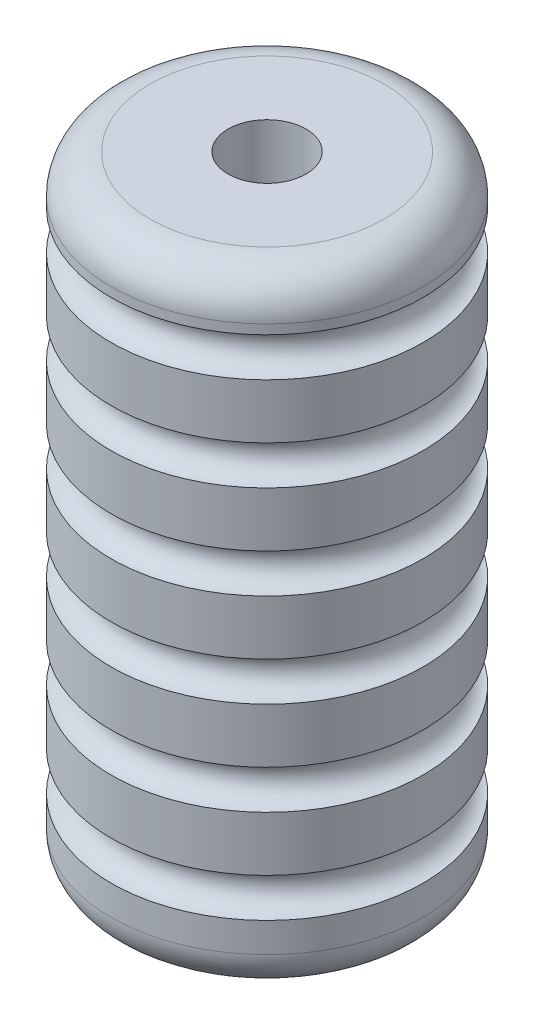
ISO-10303-21;
HEADER;
FILE_DESCRIPTION(('STEP AP214'),'2;1');
FILE_NAME('part.step','',(''),(''),'','','');
FILE_SCHEMA(('AUTOMOTIVE_DESIGN { 1 0 10303 214 1 1 1 1 }'));
ENDSEC;
DATA;
#1=APPLICATION_CONTEXT('core data for automotive mechanical design processes');
#2=APPLICATION_PROTOCOL_DEFINITION('international standard','automotive_design',2000,#1);
#3=PRODUCT_CONTEXT('',#1,'mechanical');
#4=PRODUCT('Part','Part','',(#3));
#5=PRODUCT_RELATED_PRODUCT_CATEGORY('part','',(#4));
#6=PRODUCT_DEFINITION_FORMATION('','',#4);
#7=PRODUCT_DEFINITION_CONTEXT('part definition',#1,'design');
#8=PRODUCT_DEFINITION('design','',#6,#7);
#9=PRODUCT_DEFINITION_SHAPE('','',#8);
#10=(LENGTH_UNIT() NAMED_UNIT(*) SI_UNIT(.MILLI.,.METRE.));
#11=(NAMED_UNIT(*) PLANE_ANGLE_UNIT() SI_UNIT($,.RADIAN.));
#12=(NAMED_UNIT(*) SI_UNIT($,.STERADIAN.) SOLID_ANGLE_UNIT());
#13=UNCERTAINTY_MEASURE_WITH_UNIT(LENGTH_MEASURE(1.E-05),#10,'distance_accuracy_value','');
#14=(GEOMETRIC_REPRESENTATION_CONTEXT(3) GLOBAL_UNCERTAINTY_ASSIGNED_CONTEXT((#13)) GLOBAL_UNIT_ASSIGNED_CONTEXT((#10,
#11,#12)) REPRESENTATION_CONTEXT('',''));
#15=CARTESIAN_POINT('',(0.,0.,0.));
#16=DIRECTION('',(0.,0.,1.));
#17=DIRECTION('',(1.,0.,0.));
#18=AXIS2_PLACEMENT_3D('',#15,#16,#17);
#19=CARTESIAN_POINT('',(0.,101.6,0.));
#20=DIRECTION('',(0.,1.,0.));
#21=DIRECTION('',(0.,0.,1.));
#22=AXIS2_PLACEMENT_3D('',#19,#20,#21);
#23=PLANE('',#22);
#24=CARTESIAN_POINT('',(0.,101.6,0.));
#25=DIRECTION('',(0.,1.,0.));
#26=DIRECTION('',(0.,0.,1.));
#27=AXIS2_PLACEMENT_3D('',#24,#25,#26);
#28=CIRCLE('',#27,6.35);
#29=CARTESIAN_POINT('',(0.,101.6,6.35));
#30=VERTEX_POINT('',#29);
#31=EDGE_CURVE('E87',#30,#30,#28,.T.);
#32=ORIENTED_EDGE('',*,*,#31,.F.);
#33=EDGE_LOOP('',(#32));
#34=FACE_BOUND('',#33,.T.);
#35=CARTESIAN_POINT('',(0.,101.6,0.));
#36=DIRECTION('',(0.,-1.,0.));
#37=DIRECTION('',(0.,0.,-1.));
#38=AXIS2_PLACEMENT_3D('',#35,#36,#37);
#39=CIRCLE('',#38,19.05);
#40=CARTESIAN_POINT('',(0.,101.6,-19.05));
#41=VERTEX_POINT('',#40);
#42=EDGE_CURVE('E10',#41,#41,#39,.T.);
#43=ORIENTED_EDGE('',*,*,#42,.F.);
#44=EDGE_LOOP('',(#43));
#45=FACE_BOUND('',#44,.T.);
#46=ADVANCED_FACE('F31',(#34,#45),#23,.T.);
#47=CARTESIAN_POINT('',(0.,95.25,0.));
#48=DIRECTION('',(0.,-1.,0.));
#49=DIRECTION('',(0.,0.,-1.));
#50=AXIS2_PLACEMENT_3D('',#47,#48,#49);
#51=TOROIDAL_SURFACE('',#50,19.05,6.35);
#52=ORIENTED_EDGE('',*,*,#42,.T.);
#53=EDGE_LOOP('',(#52));
#54=FACE_BOUND('',#53,.T.);
#55=CARTESIAN_POINT('',(0.,95.2499999999999,0.));
#56=DIRECTION('',(0.,-1.,0.));
#57=DIRECTION('',(0.,0.,-1.));
#58=AXIS2_PLACEMENT_3D('',#55,#56,#57);
#59=CIRCLE('',#58,25.4);
#60=CARTESIAN_POINT('',(0.,95.2499999999999,-25.4));
#61=VERTEX_POINT('',#60);
#62=EDGE_CURVE('E37',#61,#61,#59,.T.);
#63=ORIENTED_EDGE('',*,*,#62,.F.);
#64=EDGE_LOOP('',(#63));
#65=FACE_BOUND('',#64,.T.);
#66=ADVANCED_FACE('F104',(#54,#65),#51,.T.);
#67=CARTESIAN_POINT('',(0.,0.,0.));
#68=DIRECTION('',(0.,-1.,0.));
#69=DIRECTION('',(0.,0.,-1.));
#70=AXIS2_PLACEMENT_3D('',#67,#68,#69);
#71=CYLINDRICAL_SURFACE('',#70,25.4);
#72=ORIENTED_EDGE('',*,*,#62,.T.);
#73=EDGE_LOOP('',(#72));
#74=FACE_BOUND('',#73,.T.);
#75=CARTESIAN_POINT('',(0.,93.7227179265867,0.));
#76=DIRECTION('',(0.,-1.,0.));
#77=DIRECTION('',(0.,0.,-1.));
#78=AXIS2_PLACEMENT_3D('',#75,#76,#77);
#79=CIRCLE('',#78,25.4);
#80=CARTESIAN_POINT('',(0.,93.7227179265867,-25.4));
#81=VERTEX_POINT('',#80);
#82=EDGE_CURVE('E41',#81,#81,#79,.T.);
#83=ORIENTED_EDGE('',*,*,#82,.F.);
#84=EDGE_LOOP('',(#83));
#85=FACE_BOUND('',#84,.T.);
#86=ADVANCED_FACE('F108',(#74,#85),#71,.T.);
#87=CARTESIAN_POINT('',(0.,90.5477179265867,0.));
#88=DIRECTION('',(0.,-1.,0.));
#89=DIRECTION('',(0.,0.,-1.));
#90=AXIS2_PLACEMENT_3D('',#87,#88,#89);
#91=TOROIDAL_SURFACE('',#90,25.4,3.175);
#92=ORIENTED_EDGE('',*,*,#82,.T.);
#93=EDGE_LOOP('',(#92));
#94=FACE_BOUND('',#93,.T.);
#95=CARTESIAN_POINT('',(0.,87.3727179265867,0.));
#96=DIRECTION('',(0.,-1.,0.));
#97=DIRECTION('',(0.,0.,-1.));
#98=AXIS2_PLACEMENT_3D('',#95,#96,#97);
#99=CIRCLE('',#98,25.4);
#100=CARTESIAN_POINT('',(0.,87.3727179265867,-25.4));
#101=VERTEX_POINT('',#100);
#102=EDGE_CURVE('E45',#101,#101,#99,.T.);
#103=ORIENTED_EDGE('',*,*,#102,.F.);
#104=EDGE_LOOP('',(#103));
#105=FACE_BOUND('',#104,.T.);
#106=ADVANCED_FACE('F112',(#94,#105),#91,.F.);
#107=CARTESIAN_POINT('',(0.,0.,0.));
#108=DIRECTION('',(0.,-1.,0.));
#109=DIRECTION('',(0.,0.,-1.));
#110=AXIS2_PLACEMENT_3D('',#107,#108,#109);
#111=CYLINDRICAL_SURFACE('',#110,25.4);
#112=ORIENTED_EDGE('',*,*,#102,.T.);
#113=EDGE_LOOP('',(#112));
#114=FACE_BOUND('',#113,.T.);
#115=CARTESIAN_POINT('',(0.,78.4827179265867,0.));
#116=DIRECTION('',(0.,-1.,0.));
#117=DIRECTION('',(0.,0.,-1.));
#118=AXIS2_PLACEMENT_3D('',#115,#116,#117);
#119=CIRCLE('',#118,25.4);
#120=CARTESIAN_POINT('',(0.,78.4827179265867,-25.4));
#121=VERTEX_POINT('',#120);
#122=EDGE_CURVE('E50',#121,#121,#119,.T.);
#123=ORIENTED_EDGE('',*,*,#122,.F.);
#124=EDGE_LOOP('',(#123));
#125=FACE_BOUND('',#124,.T.);
#126=ADVANCED_FACE('F118',(#114,#125),#111,.T.);
#127=CARTESIAN_POINT('',(0.,75.3077179265867,0.));
#128=DIRECTION('',(0.,-1.,0.));
#129=DIRECTION('',(0.,0.,-1.));
#130=AXIS2_PLACEMENT_3D('',#127,#128,#129);
#131=TOROIDAL_SURFACE('',#130,25.4000000000002,3.175);
#132=ORIENTED_EDGE('',*,*,#122,.T.);
#133=EDGE_LOOP('',(#132));
#134=FACE_BOUND('',#133,.T.);
#135=CARTESIAN_POINT('',(0.,72.1327179265867,0.));
#136=DIRECTION('',(0.,-1.,0.));
#137=DIRECTION('',(0.,0.,-1.));
#138=AXIS2_PLACEMENT_3D('',#135,#136,#137);
#139=CIRCLE('',#138,25.4);
#140=CARTESIAN_POINT('',(0.,72.1327179265867,-25.4));
#141=VERTEX_POINT('',#140);
#142=EDGE_CURVE('E53',#141,#141,#139,.T.);
#143=ORIENTED_EDGE('',*,*,#142,.F.);
#144=EDGE_LOOP('',(#143));
#145=FACE_BOUND('',#144,.T.);
#146=ADVANCED_FACE('F122',(#134,#145),#131,.F.);
#147=CARTESIAN_POINT('',(0.,0.,0.));
#148=DIRECTION('',(0.,-1.,0.));
#149=DIRECTION('',(0.,0.,-1.));
#150=AXIS2_PLACEMENT_3D('',#147,#148,#149);
#151=CYLINDRICAL_SURFACE('',#150,25.4);
#152=ORIENTED_EDGE('',*,*,#142,.T.);
#153=EDGE_LOOP('',(#152));
#154=FACE_BOUND('',#153,.T.);
#155=CARTESIAN_POINT('',(0.,63.2427179265867,0.));
#156=DIRECTION('',(0.,-1.,0.));
#157=DIRECTION('',(0.,0.,-1.));
#158=AXIS2_PLACEMENT_3D('',#155,#156,#157);
#159=CIRCLE('',#158,25.4);
#160=CARTESIAN_POINT('',(0.,63.2427179265867,-25.4));
#161=VERTEX_POINT('',#160);
#162=EDGE_CURVE('E56',#161,#161,#159,.T.);
#163=ORIENTED_EDGE('',*,*,#162,.F.);
#164=EDGE_LOOP('',(#163));
#165=FACE_BOUND('',#164,.T.);
#166=ADVANCED_FACE('F126',(#154,#165),#151,.T.);
#167=CARTESIAN_POINT('',(0.,60.0677179265867,0.));
#168=DIRECTION('',(0.,-1.,0.));
#169=DIRECTION('',(0.,0.,-1.));
#170=AXIS2_PLACEMENT_3D('',#167,#168,#169);
#171=TOROIDAL_SURFACE('',#170,25.4000000000003,3.175);
#172=ORIENTED_EDGE('',*,*,#162,.T.);
#173=EDGE_LOOP('',(#172));
#174=FACE_BOUND('',#173,.T.);
#175=CARTESIAN_POINT('',(0.,56.8927179265867,0.));
#176=DIRECTION('',(0.,-1.,0.));
#177=DIRECTION('',(0.,0.,-1.));
#178=AXIS2_PLACEMENT_3D('',#175,#176,#177);
#179=CIRCLE('',#178,25.4);
#180=CARTESIAN_POINT('',(0.,56.8927179265867,-25.4));
#181=VERTEX_POINT('',#180);
#182=EDGE_CURVE('E59',#181,#181,#179,.T.);
#183=ORIENTED_EDGE('',*,*,#182,.F.);
#184=EDGE_LOOP('',(#183));
#185=FACE_BOUND('',#184,.T.);
#186=ADVANCED_FACE('F130',(#174,#185),#171,.F.);
#187=CARTESIAN_POINT('',(0.,0.,0.));
#188=DIRECTION('',(0.,-1.,0.));
#189=DIRECTION('',(0.,0.,-1.));
#190=AXIS2_PLACEMENT_3D('',#187,#188,#189);
#191=CYLINDRICAL_SURFACE('',#190,25.4);
#192=ORIENTED_EDGE('',*,*,#182,.T.);
#193=EDGE_LOOP('',(#192));
#194=FACE_BOUND('',#193,.T.);
#195=CARTESIAN_POINT('',(0.,48.0027179265867,0.));
#196=DIRECTION('',(0.,-1.,0.));
#197=DIRECTION('',(0.,0.,-1.));
#198=AXIS2_PLACEMENT_3D('',#195,#196,#197);
#199=CIRCLE('',#198,25.4);
#200=CARTESIAN_POINT('',(0.,48.0027179265867,-25.4));
#201=VERTEX_POINT('',#200);
#202=EDGE_CURVE('E62',#201,#201,#199,.T.);
#203=ORIENTED_EDGE('',*,*,#202,.F.);
#204=EDGE_LOOP('',(#203));
#205=FACE_BOUND('',#204,.T.);
#206=ADVANCED_FACE('F134',(#194,#205),#191,.T.);
#207=CARTESIAN_POINT('',(0.,44.8277179265867,0.));
#208=DIRECTION('',(0.,-1.,0.));
#209=DIRECTION('',(0.,0.,-1.));
#210=AXIS2_PLACEMENT_3D('',#207,#208,#209);
#211=TOROIDAL_SURFACE('',#210,25.4000000000005,3.175);
#212=ORIENTED_EDGE('',*,*,#202,.T.);
#213=EDGE_LOOP('',(#212));
#214=FACE_BOUND('',#213,.T.);
#215=CARTESIAN_POINT('',(0.,41.6527179265867,0.));
#216=DIRECTION('',(0.,-1.,0.));
#217=DIRECTION('',(0.,0.,-1.));
#218=AXIS2_PLACEMENT_3D('',#215,#216,#217);
#219=CIRCLE('',#218,25.4);
#220=CARTESIAN_POINT('',(0.,41.6527179265867,-25.4));
#221=VERTEX_POINT('',#220);
#222=EDGE_CURVE('E65',#221,#221,#219,.T.);
#223=ORIENTED_EDGE('',*,*,#222,.F.);
#224=EDGE_LOOP('',(#223));
#225=FACE_BOUND('',#224,.T.);
#226=ADVANCED_FACE('F138',(#214,#225),#211,.F.);
#227=CARTESIAN_POINT('',(0.,0.,0.));
#228=DIRECTION('',(0.,-1.,0.));
#229=DIRECTION('',(0.,0.,-1.));
#230=AXIS2_PLACEMENT_3D('',#227,#228,#229);
#231=CYLINDRICAL_SURFACE('',#230,25.4);
#232=ORIENTED_EDGE('',*,*,#222,.T.);
#233=EDGE_LOOP('',(#232));
#234=FACE_BOUND('',#233,.T.);
#235=CARTESIAN_POINT('',(0.,32.7627179265867,0.));
#236=DIRECTION('',(0.,-1.,0.));
#237=DIRECTION('',(0.,0.,-1.));
#238=AXIS2_PLACEMENT_3D('',#235,#236,#237);
#239=CIRCLE('',#238,25.4);
#240=CARTESIAN_POINT('',(0.,32.7627179265867,-25.4));
#241=VERTEX_POINT('',#240);
#242=EDGE_CURVE('E68',#241,#241,#239,.T.);
#243=ORIENTED_EDGE('',*,*,#242,.F.);
#244=EDGE_LOOP('',(#243));
#245=FACE_BOUND('',#244,.T.);
#246=ADVANCED_FACE('F142',(#234,#245),#231,.T.);
#247=CARTESIAN_POINT('',(0.,29.5877179265867,0.));
#248=DIRECTION('',(0.,-1.,0.));
#249=DIRECTION('',(0.,0.,-1.));
#250=AXIS2_PLACEMENT_3D('',#247,#248,#249);
#251=TOROIDAL_SURFACE('',#250,25.4000000000006,3.175);
#252=ORIENTED_EDGE('',*,*,#242,.T.);
#253=EDGE_LOOP('',(#252));
#254=FACE_BOUND('',#253,.T.);
#255=CARTESIAN_POINT('',(0.,26.4127179265867,0.));
#256=DIRECTION('',(0.,-1.,0.));
#257=DIRECTION('',(0.,0.,-1.));
#258=AXIS2_PLACEMENT_3D('',#255,#256,#257);
#259=CIRCLE('',#258,25.4);
#260=CARTESIAN_POINT('',(0.,26.4127179265867,-25.4));
#261=VERTEX_POINT('',#260);
#262=EDGE_CURVE('E71',#261,#261,#259,.T.);
#263=ORIENTED_EDGE('',*,*,#262,.F.);
#264=EDGE_LOOP('',(#263));
#265=FACE_BOUND('',#264,.T.);
#266=ADVANCED_FACE('F146',(#254,#265),#251,.F.);
#267=CARTESIAN_POINT('',(0.,0.,0.));
#268=DIRECTION('',(0.,-1.,0.));
#269=DIRECTION('',(0.,0.,-1.));
#270=AXIS2_PLACEMENT_3D('',#267,#268,#269);
#271=CYLINDRICAL_SURFACE('',#270,25.4);
#272=ORIENTED_EDGE('',*,*,#262,.T.);
#273=EDGE_LOOP('',(#272));
#274=FACE_BOUND('',#273,.T.);
#275=CARTESIAN_POINT('',(0.,17.5227179265867,0.));
#276=DIRECTION('',(0.,-1.,0.));
#277=DIRECTION('',(0.,0.,-1.));
#278=AXIS2_PLACEMENT_3D('',#275,#276,#277);
#279=CIRCLE('',#278,25.4);
#280=CARTESIAN_POINT('',(0.,17.5227179265867,-25.4));
#281=VERTEX_POINT('',#280);
#282=EDGE_CURVE('E74',#281,#281,#279,.T.);
#283=ORIENTED_EDGE('',*,*,#282,.F.);
#284=EDGE_LOOP('',(#283));
#285=FACE_BOUND('',#284,.T.);
#286=ADVANCED_FACE('F150',(#274,#285),#271,.T.);
#287=CARTESIAN_POINT('',(0.,14.3477179265867,0.));
#288=DIRECTION('',(0.,-1.,0.));
#289=DIRECTION('',(0.,0.,-1.));
#290=AXIS2_PLACEMENT_3D('',#287,#288,#289);
#291=TOROIDAL_SURFACE('',#290,25.4000000000008,3.175);
#292=ORIENTED_EDGE('',*,*,#282,.T.);
#293=EDGE_LOOP('',(#292));
#294=FACE_BOUND('',#293,.T.);
#295=CARTESIAN_POINT('',(0.,11.1727179265867,0.));
#296=DIRECTION('',(0.,-1.,0.));
#297=DIRECTION('',(0.,0.,-1.));
#298=AXIS2_PLACEMENT_3D('',#295,#296,#297);
#299=CIRCLE('',#298,25.4);
#300=CARTESIAN_POINT('',(0.,11.1727179265867,-25.4));
#301=VERTEX_POINT('',#300);
#302=EDGE_CURVE('E77',#301,#301,#299,.T.);
#303=ORIENTED_EDGE('',*,*,#302,.F.);
#304=EDGE_LOOP('',(#303));
#305=FACE_BOUND('',#304,.T.);
#306=ADVANCED_FACE('F154',(#294,#305),#291,.F.);
#307=CARTESIAN_POINT('',(0.,0.,0.));
#308=DIRECTION('',(0.,-1.,0.));
#309=DIRECTION('',(0.,0.,-1.));
#310=AXIS2_PLACEMENT_3D('',#307,#308,#309);
#311=CYLINDRICAL_SURFACE('',#310,25.4);
#312=ORIENTED_EDGE('',*,*,#302,.T.);
#313=EDGE_LOOP('',(#312));
#314=FACE_BOUND('',#313,.T.);
#315=CARTESIAN_POINT('',(0.,6.35,0.));
#316=DIRECTION('',(0.,-1.,0.));
#317=DIRECTION('',(0.,0.,-1.));
#318=AXIS2_PLACEMENT_3D('',#315,#316,#317);
#319=CIRCLE('',#318,25.4);
#320=CARTESIAN_POINT('',(0.,6.35,-25.4));
#321=VERTEX_POINT('',#320);
#322=EDGE_CURVE('E80',#321,#321,#319,.T.);
#323=ORIENTED_EDGE('',*,*,#322,.F.);
#324=EDGE_LOOP('',(#323));
#325=FACE_BOUND('',#324,.T.);
#326=ADVANCED_FACE('F158',(#314,#325),#311,.T.);
#327=CARTESIAN_POINT('',(0.,6.35,0.));
#328=DIRECTION('',(0.,-1.,0.));
#329=DIRECTION('',(0.,0.,-1.));
#330=AXIS2_PLACEMENT_3D('',#327,#328,#329);
#331=TOROIDAL_SURFACE('',#330,19.05,6.35);
#332=ORIENTED_EDGE('',*,*,#322,.T.);
#333=EDGE_LOOP('',(#332));
#334=FACE_BOUND('',#333,.T.);
#335=CARTESIAN_POINT('',(0.,0.,0.));
#336=DIRECTION('',(0.,-1.,0.));
#337=DIRECTION('',(0.,0.,-1.));
#338=AXIS2_PLACEMENT_3D('',#335,#336,#337);
#339=CIRCLE('',#338,19.05);
#340=CARTESIAN_POINT('',(0.,0.,-19.05));
#341=VERTEX_POINT('',#340);
#342=EDGE_CURVE('E83',#341,#341,#339,.T.);
#343=ORIENTED_EDGE('',*,*,#342,.F.);
#344=EDGE_LOOP('',(#343));
#345=FACE_BOUND('',#344,.T.);
#346=ADVANCED_FACE('F162',(#334,#345),#331,.T.);
#347=CARTESIAN_POINT('',(0.,0.,0.));
#348=DIRECTION('',(0.,-1.,0.));
#349=DIRECTION('',(0.,0.,-1.));
#350=AXIS2_PLACEMENT_3D('',#347,#348,#349);
#351=PLANE('',#350);
#352=CARTESIAN_POINT('',(0.,0.,0.));
#353=DIRECTION('',(0.,1.,0.));
#354=DIRECTION('',(0.,0.,1.));
#355=AXIS2_PLACEMENT_3D('',#352,#353,#354);
#356=CIRCLE('',#355,6.35);
#357=CARTESIAN_POINT('',(0.,0.,6.35));
#358=VERTEX_POINT('',#357);
#359=EDGE_CURVE('E86',#358,#358,#356,.T.);
#360=ORIENTED_EDGE('',*,*,#359,.T.);
#361=EDGE_LOOP('',(#360));
#362=FACE_BOUND('',#361,.T.);
#363=ORIENTED_EDGE('',*,*,#342,.T.);
#364=EDGE_LOOP('',(#363));
#365=FACE_BOUND('',#364,.T.);
#366=ADVANCED_FACE('F93',(#362,#365),#351,.T.);
#367=CARTESIAN_POINT('',(0.,0.,0.));
#368=DIRECTION('',(0.,1.,0.));
#369=DIRECTION('',(0.,0.,1.));
#370=AXIS2_PLACEMENT_3D('',#367,#368,#369);
#371=CYLINDRICAL_SURFACE('',#370,6.35);
#372=ORIENTED_EDGE('',*,*,#359,.F.);
#373=EDGE_LOOP('',(#372));
#374=FACE_BOUND('',#373,.T.);
#375=ORIENTED_EDGE('',*,*,#31,.T.);
#376=EDGE_LOOP('',(#375));
#377=FACE_BOUND('',#376,.T.);
#378=ADVANCED_FACE('F96',(#374,#377),#371,.F.);
#379=CLOSED_SHELL('',(#46,#66,#86,#106,#126,#146,#166,#186,#206,#226,#246,#266,#286,#306,#326,
#346,#366,#378));
#380=MANIFOLD_SOLID_BREP('B2',#379);
#381=ADVANCED_BREP_SHAPE_REPRESENTATION('',(#18,#380),#14);
#382=SHAPE_DEFINITION_REPRESENTATION(#9,#381);
ENDSEC;
END-ISO-10303-21;
